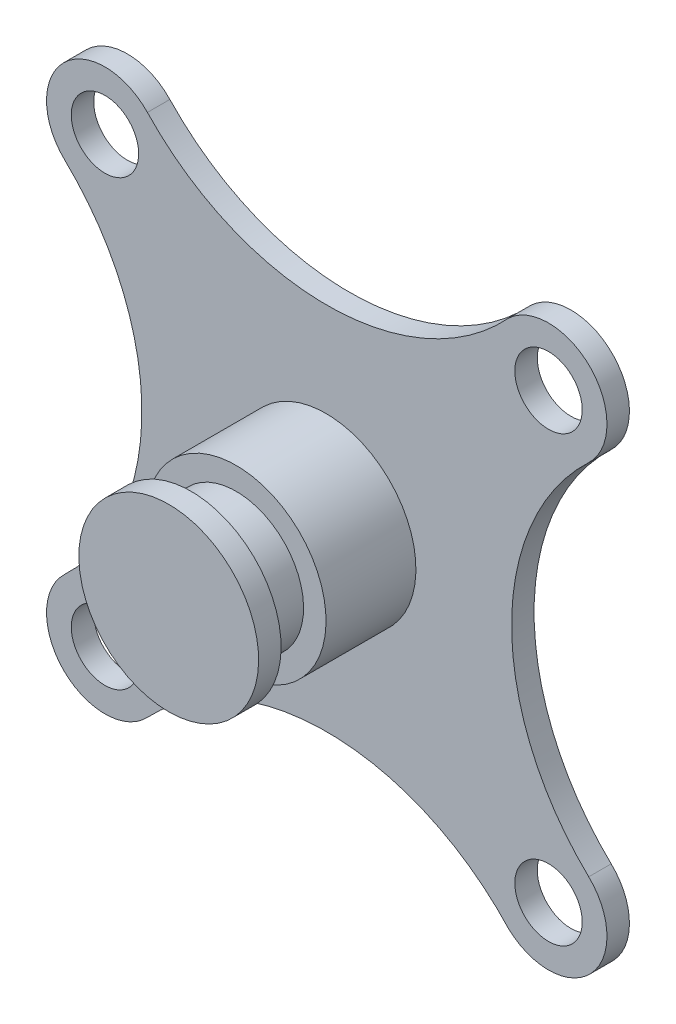
ISO-10303-21;
HEADER;
FILE_DESCRIPTION(('STEP AP214'),'2;1');
FILE_NAME('part.step','',(''),(''),'','','');
FILE_SCHEMA(('AUTOMOTIVE_DESIGN { 1 0 10303 214 1 1 1 1 }'));
ENDSEC;
DATA;
#1=APPLICATION_CONTEXT('core data for automotive mechanical design processes');
#2=APPLICATION_PROTOCOL_DEFINITION('international standard','automotive_design',2000,#1);
#3=PRODUCT_CONTEXT('',#1,'mechanical');
#4=PRODUCT('Part','Part','',(#3));
#5=PRODUCT_RELATED_PRODUCT_CATEGORY('part','',(#4));
#6=PRODUCT_DEFINITION_FORMATION('','',#4);
#7=PRODUCT_DEFINITION_CONTEXT('part definition',#1,'design');
#8=PRODUCT_DEFINITION('design','',#6,#7);
#9=PRODUCT_DEFINITION_SHAPE('','',#8);
#10=(LENGTH_UNIT() NAMED_UNIT(*) SI_UNIT(.MILLI.,.METRE.));
#11=(NAMED_UNIT(*) PLANE_ANGLE_UNIT() SI_UNIT($,.RADIAN.));
#12=(NAMED_UNIT(*) SI_UNIT($,.STERADIAN.) SOLID_ANGLE_UNIT());
#13=UNCERTAINTY_MEASURE_WITH_UNIT(LENGTH_MEASURE(1.E-05),#10,'distance_accuracy_value','');
#14=(GEOMETRIC_REPRESENTATION_CONTEXT(3) GLOBAL_UNCERTAINTY_ASSIGNED_CONTEXT((#13)) GLOBAL_UNIT_ASSIGNED_CONTEXT((#10,
#11,#12)) REPRESENTATION_CONTEXT('',''));
#15=CARTESIAN_POINT('',(0.,0.,0.));
#16=DIRECTION('',(0.,0.,1.));
#17=DIRECTION('',(1.,0.,0.));
#18=AXIS2_PLACEMENT_3D('',#15,#16,#17);
#19=CARTESIAN_POINT('',(-72.5815017066124,24.5154015644505,-20.));
#20=DIRECTION('',(0.,0.,1.));
#21=DIRECTION('',(0.,-1.,0.));
#22=AXIS2_PLACEMENT_3D('',#19,#20,#21);
#23=PLANE('',#22);
#24=CARTESIAN_POINT('',(0.,0.,-20.));
#25=DIRECTION('',(0.,0.,1.));
#26=DIRECTION('',(0.,-1.,0.));
#27=AXIS2_PLACEMENT_3D('',#24,#25,#26);
#28=CIRCLE('',#27,20.);
#29=CARTESIAN_POINT('',(0.,-20.,-20.));
#30=VERTEX_POINT('',#29);
#31=EDGE_CURVE('E204',#30,#30,#28,.T.);
#32=ORIENTED_EDGE('',*,*,#31,.F.);
#33=EDGE_LOOP('',(#32));
#34=FACE_BOUND('',#33,.T.);
#35=CARTESIAN_POINT('',(-49.1869407359166,-49.499803987487,-20.));
#36=DIRECTION('',(0.,0.,1.));
#37=DIRECTION('',(0.,-1.,0.));
#38=AXIS2_PLACEMENT_3D('',#35,#36,#37);
#39=CIRCLE('',#38,7.5);
#40=CARTESIAN_POINT('',(-49.1869407359166,-56.999803987487,-20.));
#41=VERTEX_POINT('',#40);
#42=EDGE_CURVE('E189',#41,#41,#39,.T.);
#43=ORIENTED_EDGE('',*,*,#42,.F.);
#44=EDGE_LOOP('',(#43));
#45=FACE_BOUND('',#44,.T.);
#46=CARTESIAN_POINT('',(-49.1869407359166,49.1871367484297,-20.));
#47=DIRECTION('',(0.,0.,1.));
#48=DIRECTION('',(0.,-1.,0.));
#49=AXIS2_PLACEMENT_3D('',#46,#47,#48);
#50=CIRCLE('',#49,7.5);
#51=CARTESIAN_POINT('',(-49.1869407359166,41.6871367484297,-20.));
#52=VERTEX_POINT('',#51);
#53=EDGE_CURVE('E135',#52,#52,#50,.T.);
#54=ORIENTED_EDGE('',*,*,#53,.F.);
#55=EDGE_LOOP('',(#54));
#56=FACE_BOUND('',#55,.T.);
#57=CARTESIAN_POINT('',(-95.9760626773083,-0.156333619528666,-20.));
#58=DIRECTION('',(0.,0.,-1.));
#59=DIRECTION('',(0.,-1.,0.));
#60=AXIS2_PLACEMENT_3D('',#57,#58,#59);
#61=CIRCLE('',#60,55.);
#62=CARTESIAN_POINT('',(-58.1319199305945,39.7538262369082,-20.));
#63=VERTEX_POINT('',#62);
#64=CARTESIAN_POINT('',(-58.1319199305944,-40.0664934759656,-20.));
#65=VERTEX_POINT('',#64);
#66=EDGE_CURVE('E146',#63,#65,#61,.T.);
#67=ORIENTED_EDGE('',*,*,#66,.T.);
#68=CARTESIAN_POINT('',(-49.1869407359166,-49.499803987487,-20.));
#69=DIRECTION('',(0.,0.,1.));
#70=DIRECTION('',(0.,-1.,0.));
#71=AXIS2_PLACEMENT_3D('',#68,#69,#70);
#72=CIRCLE('',#71,13.);
#73=CARTESIAN_POINT('',(-39.7492204837325,-58.4401304044313,-20.));
#74=VERTEX_POINT('',#73);
#75=EDGE_CURVE('E94',#65,#74,#72,.T.);
#76=ORIENTED_EDGE('',*,*,#75,.T.);
#77=CARTESIAN_POINT('',(0.179595967815818,-96.2645883222729,-20.));
#78=DIRECTION('',(0.,0.,-1.));
#79=DIRECTION('',(0.,-1.,0.));
#80=AXIS2_PLACEMENT_3D('',#77,#78,#79);
#81=CIRCLE('',#80,55.);
#82=CARTESIAN_POINT('',(40.6632357648317,-59.0345613442344,-20.));
#83=VERTEX_POINT('',#82);
#84=EDGE_CURVE('E161',#74,#83,#81,.T.);
#85=ORIENTED_EDGE('',*,*,#84,.T.);
#86=CARTESIAN_POINT('',(49.5,-49.499803987487,-20.));
#87=DIRECTION('',(0.,0.,1.));
#88=DIRECTION('',(0.,-1.,0.));
#89=AXIS2_PLACEMENT_3D('',#86,#87,#88);
#90=CIRCLE('',#89,13.);
#91=CARTESIAN_POINT('',(58.4449791946778,-40.0664934759655,-20.));
#92=VERTEX_POINT('',#91);
#93=EDGE_CURVE('E174',#83,#92,#90,.T.);
#94=ORIENTED_EDGE('',*,*,#93,.T.);
#95=CARTESIAN_POINT('',(96.2891219413917,-0.156333619528666,-20.));
#96=DIRECTION('',(0.,0.,-1.));
#97=DIRECTION('',(0.,1.,0.));
#98=AXIS2_PLACEMENT_3D('',#95,#96,#97);
#99=CIRCLE('',#98,55.);
#100=CARTESIAN_POINT('',(58.4449791946778,39.7538262369082,-20.));
#101=VERTEX_POINT('',#100);
#102=EDGE_CURVE('E113',#92,#101,#99,.T.);
#103=ORIENTED_EDGE('',*,*,#102,.T.);
#104=CARTESIAN_POINT('',(49.5,49.1871367484297,-20.));
#105=DIRECTION('',(0.,0.,1.));
#106=DIRECTION('',(0.,-1.,0.));
#107=AXIS2_PLACEMENT_3D('',#104,#105,#106);
#108=CIRCLE('',#107,13.);
#109=CARTESIAN_POINT('',(40.6632357648317,58.7218941051771,-20.));
#110=VERTEX_POINT('',#109);
#111=EDGE_CURVE('E107',#101,#110,#108,.T.);
#112=ORIENTED_EDGE('',*,*,#111,.T.);
#113=CARTESIAN_POINT('',(0.17959596781586,95.9519210832156,-20.));
#114=DIRECTION('',(0.,0.,-1.));
#115=DIRECTION('',(0.,1.,0.));
#116=AXIS2_PLACEMENT_3D('',#113,#114,#115);
#117=CIRCLE('',#116,55.);
#118=CARTESIAN_POINT('',(-39.7492204837324,58.127463165374,-20.));
#119=VERTEX_POINT('',#118);
#120=EDGE_CURVE('E111',#110,#119,#117,.T.);
#121=ORIENTED_EDGE('',*,*,#120,.T.);
#122=CARTESIAN_POINT('',(-49.1869407359166,49.1871367484297,-20.));
#123=DIRECTION('',(0.,0.,1.));
#124=DIRECTION('',(0.,-1.,0.));
#125=AXIS2_PLACEMENT_3D('',#122,#123,#124);
#126=CIRCLE('',#125,13.);
#127=EDGE_CURVE('E51',#119,#63,#126,.T.);
#128=ORIENTED_EDGE('',*,*,#127,.T.);
#129=EDGE_LOOP('',(#67,#76,#85,#94,#103,#112,#121,#128));
#130=FACE_BOUND('',#129,.T.);
#131=CARTESIAN_POINT('',(49.5,49.1871367484297,-20.));
#132=DIRECTION('',(0.,0.,1.));
#133=DIRECTION('',(0.,-1.,0.));
#134=AXIS2_PLACEMENT_3D('',#131,#132,#133);
#135=CIRCLE('',#134,7.5);
#136=CARTESIAN_POINT('',(49.5,41.6871367484297,-20.));
#137=VERTEX_POINT('',#136);
#138=EDGE_CURVE('E183',#137,#137,#135,.T.);
#139=ORIENTED_EDGE('',*,*,#138,.F.);
#140=EDGE_LOOP('',(#139));
#141=FACE_BOUND('',#140,.T.);
#142=CARTESIAN_POINT('',(49.5,-49.499803987487,-20.));
#143=DIRECTION('',(0.,0.,1.));
#144=DIRECTION('',(0.,-1.,0.));
#145=AXIS2_PLACEMENT_3D('',#142,#143,#144);
#146=CIRCLE('',#145,7.5);
#147=CARTESIAN_POINT('',(49.5,-56.999803987487,-20.));
#148=VERTEX_POINT('',#147);
#149=EDGE_CURVE('E195',#148,#148,#146,.T.);
#150=ORIENTED_EDGE('',*,*,#149,.F.);
#151=EDGE_LOOP('',(#150));
#152=FACE_BOUND('',#151,.T.);
#153=ADVANCED_FACE('F34',(#34,#45,#56,#130,#141,#152),#23,.T.);
#154=CARTESIAN_POINT('',(-72.5815017066124,24.5154015644505,-25.));
#155=DIRECTION('',(0.,0.,1.));
#156=DIRECTION('',(0.,-1.,0.));
#157=AXIS2_PLACEMENT_3D('',#154,#155,#156);
#158=PLANE('',#157);
#159=CARTESIAN_POINT('',(-95.9760626773083,-0.156333619528666,-25.));
#160=DIRECTION('',(0.,0.,-1.));
#161=DIRECTION('',(0.,-1.,0.));
#162=AXIS2_PLACEMENT_3D('',#159,#160,#161);
#163=CIRCLE('',#162,55.);
#164=CARTESIAN_POINT('',(-58.1319199305945,39.7538262369082,-25.));
#165=VERTEX_POINT('',#164);
#166=CARTESIAN_POINT('',(-58.1319199305944,-40.0664934759656,-25.));
#167=VERTEX_POINT('',#166);
#168=EDGE_CURVE('E131',#165,#167,#163,.T.);
#169=ORIENTED_EDGE('',*,*,#168,.F.);
#170=CARTESIAN_POINT('',(-49.1869407359166,49.1871367484297,-25.));
#171=DIRECTION('',(0.,0.,1.));
#172=DIRECTION('',(0.,-1.,0.));
#173=AXIS2_PLACEMENT_3D('',#170,#171,#172);
#174=CIRCLE('',#173,13.);
#175=CARTESIAN_POINT('',(-39.7492204837324,58.127463165374,-25.));
#176=VERTEX_POINT('',#175);
#177=EDGE_CURVE('E86',#176,#165,#174,.T.);
#178=ORIENTED_EDGE('',*,*,#177,.F.);
#179=CARTESIAN_POINT('',(0.17959596781586,95.9519210832156,-25.));
#180=DIRECTION('',(0.,0.,-1.));
#181=DIRECTION('',(0.,1.,0.));
#182=AXIS2_PLACEMENT_3D('',#179,#180,#181);
#183=CIRCLE('',#182,55.);
#184=CARTESIAN_POINT('',(40.6632357648317,58.7218941051771,-25.));
#185=VERTEX_POINT('',#184);
#186=EDGE_CURVE('E80',#185,#176,#183,.T.);
#187=ORIENTED_EDGE('',*,*,#186,.F.);
#188=CARTESIAN_POINT('',(49.5,49.1871367484297,-25.));
#189=DIRECTION('',(0.,0.,1.));
#190=DIRECTION('',(0.,-1.,0.));
#191=AXIS2_PLACEMENT_3D('',#188,#189,#190);
#192=CIRCLE('',#191,13.);
#193=CARTESIAN_POINT('',(58.4449791946778,39.7538262369082,-25.));
#194=VERTEX_POINT('',#193);
#195=EDGE_CURVE('E121',#194,#185,#192,.T.);
#196=ORIENTED_EDGE('',*,*,#195,.F.);
#197=CARTESIAN_POINT('',(96.2891219413917,-0.156333619528666,-25.));
#198=DIRECTION('',(0.,0.,-1.));
#199=DIRECTION('',(0.,1.,0.));
#200=AXIS2_PLACEMENT_3D('',#197,#198,#199);
#201=CIRCLE('',#200,55.);
#202=CARTESIAN_POINT('',(58.4449791946778,-40.0664934759655,-25.));
#203=VERTEX_POINT('',#202);
#204=EDGE_CURVE('E141',#203,#194,#201,.T.);
#205=ORIENTED_EDGE('',*,*,#204,.F.);
#206=CARTESIAN_POINT('',(49.5,-49.499803987487,-25.));
#207=DIRECTION('',(0.,0.,1.));
#208=DIRECTION('',(0.,-1.,0.));
#209=AXIS2_PLACEMENT_3D('',#206,#207,#208);
#210=CIRCLE('',#209,13.);
#211=CARTESIAN_POINT('',(40.6632357648317,-59.0345613442344,-25.));
#212=VERTEX_POINT('',#211);
#213=EDGE_CURVE('E139',#212,#203,#210,.T.);
#214=ORIENTED_EDGE('',*,*,#213,.F.);
#215=CARTESIAN_POINT('',(0.179595967815818,-96.2645883222729,-25.));
#216=DIRECTION('',(0.,0.,-1.));
#217=DIRECTION('',(0.,-1.,0.));
#218=AXIS2_PLACEMENT_3D('',#215,#216,#217);
#219=CIRCLE('',#218,55.);
#220=CARTESIAN_POINT('',(-39.7492204837325,-58.4401304044313,-25.));
#221=VERTEX_POINT('',#220);
#222=EDGE_CURVE('E137',#221,#212,#219,.T.);
#223=ORIENTED_EDGE('',*,*,#222,.F.);
#224=CARTESIAN_POINT('',(-49.1869407359166,-49.499803987487,-25.));
#225=DIRECTION('',(0.,0.,1.));
#226=DIRECTION('',(0.,-1.,0.));
#227=AXIS2_PLACEMENT_3D('',#224,#225,#226);
#228=CIRCLE('',#227,13.);
#229=EDGE_CURVE('E134',#167,#221,#228,.T.);
#230=ORIENTED_EDGE('',*,*,#229,.F.);
#231=EDGE_LOOP('',(#169,#178,#187,#196,#205,#214,#223,#230));
#232=FACE_BOUND('',#231,.T.);
#233=CARTESIAN_POINT('',(-49.1869407359166,49.1871367484297,-25.));
#234=DIRECTION('',(0.,0.,1.));
#235=DIRECTION('',(0.,-1.,0.));
#236=AXIS2_PLACEMENT_3D('',#233,#234,#235);
#237=CIRCLE('',#236,7.5);
#238=CARTESIAN_POINT('',(-49.1869407359166,41.6871367484297,-25.));
#239=VERTEX_POINT('',#238);
#240=EDGE_CURVE('E180',#239,#239,#237,.T.);
#241=ORIENTED_EDGE('',*,*,#240,.T.);
#242=EDGE_LOOP('',(#241));
#243=FACE_BOUND('',#242,.T.);
#244=CARTESIAN_POINT('',(49.5,49.1871367484297,-25.));
#245=DIRECTION('',(0.,0.,1.));
#246=DIRECTION('',(0.,-1.,0.));
#247=AXIS2_PLACEMENT_3D('',#244,#245,#246);
#248=CIRCLE('',#247,7.5);
#249=CARTESIAN_POINT('',(49.5,41.6871367484297,-25.));
#250=VERTEX_POINT('',#249);
#251=EDGE_CURVE('E186',#250,#250,#248,.T.);
#252=ORIENTED_EDGE('',*,*,#251,.T.);
#253=EDGE_LOOP('',(#252));
#254=FACE_BOUND('',#253,.T.);
#255=CARTESIAN_POINT('',(-49.1869407359166,-49.499803987487,-25.));
#256=DIRECTION('',(0.,0.,1.));
#257=DIRECTION('',(0.,-1.,0.));
#258=AXIS2_PLACEMENT_3D('',#255,#256,#257);
#259=CIRCLE('',#258,7.5);
#260=CARTESIAN_POINT('',(-49.1869407359166,-56.999803987487,-25.));
#261=VERTEX_POINT('',#260);
#262=EDGE_CURVE('E192',#261,#261,#259,.T.);
#263=ORIENTED_EDGE('',*,*,#262,.T.);
#264=EDGE_LOOP('',(#263));
#265=FACE_BOUND('',#264,.T.);
#266=CARTESIAN_POINT('',(49.5,-49.499803987487,-25.));
#267=DIRECTION('',(0.,0.,1.));
#268=DIRECTION('',(0.,-1.,0.));
#269=AXIS2_PLACEMENT_3D('',#266,#267,#268);
#270=CIRCLE('',#269,7.5);
#271=CARTESIAN_POINT('',(49.5,-56.999803987487,-25.));
#272=VERTEX_POINT('',#271);
#273=EDGE_CURVE('E198',#272,#272,#270,.T.);
#274=ORIENTED_EDGE('',*,*,#273,.T.);
#275=EDGE_LOOP('',(#274));
#276=FACE_BOUND('',#275,.T.);
#277=ADVANCED_FACE('F165',(#232,#243,#254,#265,#276),#158,.F.);
#278=CARTESIAN_POINT('',(-95.9760626773083,-0.156333619528666,-20.));
#279=DIRECTION('',(0.,0.,-1.));
#280=DIRECTION('',(0.,1.,0.));
#281=AXIS2_PLACEMENT_3D('',#278,#279,#280);
#282=CYLINDRICAL_SURFACE('',#281,55.);
#283=ORIENTED_EDGE('',*,*,#168,.T.);
#284=DIRECTION('',(0.,0.,-1.));
#285=VECTOR('',#284,1.);
#286=CARTESIAN_POINT('',(-58.1319199305944,-40.0664934759656,-20.));
#287=LINE('',#286,#285);
#288=EDGE_CURVE('E11',#65,#167,#287,.T.);
#289=ORIENTED_EDGE('',*,*,#288,.F.);
#290=ORIENTED_EDGE('',*,*,#66,.F.);
#291=DIRECTION('',(0.,0.,-1.));
#292=VECTOR('',#291,1.);
#293=CARTESIAN_POINT('',(-58.1319199305945,39.7538262369082,-20.));
#294=LINE('',#293,#292);
#295=EDGE_CURVE('E127',#63,#165,#294,.T.);
#296=ORIENTED_EDGE('',*,*,#295,.T.);
#297=EDGE_LOOP('',(#283,#289,#290,#296));
#298=FACE_BOUND('',#297,.T.);
#299=ADVANCED_FACE('F36',(#298),#282,.F.);
#300=CARTESIAN_POINT('',(-49.1869407359166,-49.499803987487,-20.));
#301=DIRECTION('',(0.,0.,-1.));
#302=DIRECTION('',(0.,1.,0.));
#303=AXIS2_PLACEMENT_3D('',#300,#301,#302);
#304=CYLINDRICAL_SURFACE('',#303,13.);
#305=ORIENTED_EDGE('',*,*,#229,.T.);
#306=DIRECTION('',(0.,0.,-1.));
#307=VECTOR('',#306,1.);
#308=CARTESIAN_POINT('',(-39.7492204837325,-58.4401304044313,-20.));
#309=LINE('',#308,#307);
#310=EDGE_CURVE('E43',#74,#221,#309,.T.);
#311=ORIENTED_EDGE('',*,*,#310,.F.);
#312=ORIENTED_EDGE('',*,*,#75,.F.);
#313=ORIENTED_EDGE('',*,*,#288,.T.);
#314=EDGE_LOOP('',(#305,#311,#312,#313));
#315=FACE_BOUND('',#314,.T.);
#316=ADVANCED_FACE('F264',(#315),#304,.T.);
#317=CARTESIAN_POINT('',(0.179595967815818,-96.2645883222729,-20.));
#318=DIRECTION('',(0.,0.,-1.));
#319=DIRECTION('',(0.,1.,0.));
#320=AXIS2_PLACEMENT_3D('',#317,#318,#319);
#321=CYLINDRICAL_SURFACE('',#320,55.);
#322=ORIENTED_EDGE('',*,*,#222,.T.);
#323=DIRECTION('',(0.,0.,-1.));
#324=VECTOR('',#323,1.);
#325=CARTESIAN_POINT('',(40.6632357648317,-59.0345613442344,-20.));
#326=LINE('',#325,#324);
#327=EDGE_CURVE('E153',#83,#212,#326,.T.);
#328=ORIENTED_EDGE('',*,*,#327,.F.);
#329=ORIENTED_EDGE('',*,*,#84,.F.);
#330=ORIENTED_EDGE('',*,*,#310,.T.);
#331=EDGE_LOOP('',(#322,#328,#329,#330));
#332=FACE_BOUND('',#331,.T.);
#333=ADVANCED_FACE('F159',(#332),#321,.F.);
#334=CARTESIAN_POINT('',(49.5,-49.499803987487,-20.));
#335=DIRECTION('',(0.,0.,-1.));
#336=DIRECTION('',(0.,1.,0.));
#337=AXIS2_PLACEMENT_3D('',#334,#335,#336);
#338=CYLINDRICAL_SURFACE('',#337,13.);
#339=ORIENTED_EDGE('',*,*,#213,.T.);
#340=DIRECTION('',(0.,0.,-1.));
#341=VECTOR('',#340,1.);
#342=CARTESIAN_POINT('',(58.4449791946778,-40.0664934759655,-20.));
#343=LINE('',#342,#341);
#344=EDGE_CURVE('E150',#92,#203,#343,.T.);
#345=ORIENTED_EDGE('',*,*,#344,.F.);
#346=ORIENTED_EDGE('',*,*,#93,.F.);
#347=ORIENTED_EDGE('',*,*,#327,.T.);
#348=EDGE_LOOP('',(#339,#345,#346,#347));
#349=FACE_BOUND('',#348,.T.);
#350=ADVANCED_FACE('F170',(#349),#338,.T.);
#351=CARTESIAN_POINT('',(96.2891219413917,-0.156333619528666,-20.));
#352=DIRECTION('',(0.,0.,-1.));
#353=DIRECTION('',(0.,1.,0.));
#354=AXIS2_PLACEMENT_3D('',#351,#352,#353);
#355=CYLINDRICAL_SURFACE('',#354,55.);
#356=ORIENTED_EDGE('',*,*,#204,.T.);
#357=DIRECTION('',(0.,0.,-1.));
#358=VECTOR('',#357,1.);
#359=CARTESIAN_POINT('',(58.4449791946778,39.7538262369082,-20.));
#360=LINE('',#359,#358);
#361=EDGE_CURVE('E122',#101,#194,#360,.T.);
#362=ORIENTED_EDGE('',*,*,#361,.F.);
#363=ORIENTED_EDGE('',*,*,#102,.F.);
#364=ORIENTED_EDGE('',*,*,#344,.T.);
#365=EDGE_LOOP('',(#356,#362,#363,#364));
#366=FACE_BOUND('',#365,.T.);
#367=ADVANCED_FACE('F173',(#366),#355,.F.);
#368=CARTESIAN_POINT('',(49.5,49.1871367484297,-20.));
#369=DIRECTION('',(0.,0.,-1.));
#370=DIRECTION('',(0.,1.,0.));
#371=AXIS2_PLACEMENT_3D('',#368,#369,#370);
#372=CYLINDRICAL_SURFACE('',#371,13.);
#373=ORIENTED_EDGE('',*,*,#195,.T.);
#374=DIRECTION('',(0.,0.,-1.));
#375=VECTOR('',#374,1.);
#376=CARTESIAN_POINT('',(40.6632357648317,58.7218941051771,-20.));
#377=LINE('',#376,#375);
#378=EDGE_CURVE('E118',#110,#185,#377,.T.);
#379=ORIENTED_EDGE('',*,*,#378,.F.);
#380=ORIENTED_EDGE('',*,*,#111,.F.);
#381=ORIENTED_EDGE('',*,*,#361,.T.);
#382=EDGE_LOOP('',(#373,#379,#380,#381));
#383=FACE_BOUND('',#382,.T.);
#384=ADVANCED_FACE('F119',(#383),#372,.T.);
#385=CARTESIAN_POINT('',(0.17959596781586,95.9519210832156,-20.));
#386=DIRECTION('',(0.,0.,-1.));
#387=DIRECTION('',(0.,1.,0.));
#388=AXIS2_PLACEMENT_3D('',#385,#386,#387);
#389=CYLINDRICAL_SURFACE('',#388,55.);
#390=ORIENTED_EDGE('',*,*,#186,.T.);
#391=DIRECTION('',(0.,0.,-1.));
#392=VECTOR('',#391,1.);
#393=CARTESIAN_POINT('',(-39.7492204837324,58.127463165374,-20.));
#394=LINE('',#393,#392);
#395=EDGE_CURVE('E123',#119,#176,#394,.T.);
#396=ORIENTED_EDGE('',*,*,#395,.F.);
#397=ORIENTED_EDGE('',*,*,#120,.F.);
#398=ORIENTED_EDGE('',*,*,#378,.T.);
#399=EDGE_LOOP('',(#390,#396,#397,#398));
#400=FACE_BOUND('',#399,.T.);
#401=ADVANCED_FACE('F125',(#400),#389,.F.);
#402=CARTESIAN_POINT('',(-49.1869407359166,49.1871367484297,-20.));
#403=DIRECTION('',(0.,0.,-1.));
#404=DIRECTION('',(0.,1.,0.));
#405=AXIS2_PLACEMENT_3D('',#402,#403,#404);
#406=CYLINDRICAL_SURFACE('',#405,13.);
#407=ORIENTED_EDGE('',*,*,#177,.T.);
#408=ORIENTED_EDGE('',*,*,#295,.F.);
#409=ORIENTED_EDGE('',*,*,#127,.F.);
#410=ORIENTED_EDGE('',*,*,#395,.T.);
#411=EDGE_LOOP('',(#407,#408,#409,#410));
#412=FACE_BOUND('',#411,.T.);
#413=ADVANCED_FACE('F252',(#412),#406,.T.);
#414=CARTESIAN_POINT('',(-49.1869407359166,49.1871367484297,-20.));
#415=DIRECTION('',(0.,0.,-1.));
#416=DIRECTION('',(0.,1.,0.));
#417=AXIS2_PLACEMENT_3D('',#414,#415,#416);
#418=CYLINDRICAL_SURFACE('',#417,7.5);
#419=ORIENTED_EDGE('',*,*,#53,.T.);
#420=EDGE_LOOP('',(#419));
#421=FACE_BOUND('',#420,.T.);
#422=ORIENTED_EDGE('',*,*,#240,.F.);
#423=EDGE_LOOP('',(#422));
#424=FACE_BOUND('',#423,.T.);
#425=ADVANCED_FACE('F249',(#421,#424),#418,.F.);
#426=CARTESIAN_POINT('',(49.5,49.1871367484297,-20.));
#427=DIRECTION('',(0.,0.,-1.));
#428=DIRECTION('',(0.,1.,0.));
#429=AXIS2_PLACEMENT_3D('',#426,#427,#428);
#430=CYLINDRICAL_SURFACE('',#429,7.5);
#431=ORIENTED_EDGE('',*,*,#138,.T.);
#432=EDGE_LOOP('',(#431));
#433=FACE_BOUND('',#432,.T.);
#434=ORIENTED_EDGE('',*,*,#251,.F.);
#435=EDGE_LOOP('',(#434));
#436=FACE_BOUND('',#435,.T.);
#437=ADVANCED_FACE('F328',(#433,#436),#430,.F.);
#438=CARTESIAN_POINT('',(-49.1869407359166,-49.499803987487,-20.));
#439=DIRECTION('',(0.,0.,-1.));
#440=DIRECTION('',(0.,1.,0.));
#441=AXIS2_PLACEMENT_3D('',#438,#439,#440);
#442=CYLINDRICAL_SURFACE('',#441,7.5);
#443=ORIENTED_EDGE('',*,*,#42,.T.);
#444=EDGE_LOOP('',(#443));
#445=FACE_BOUND('',#444,.T.);
#446=ORIENTED_EDGE('',*,*,#262,.F.);
#447=EDGE_LOOP('',(#446));
#448=FACE_BOUND('',#447,.T.);
#449=ADVANCED_FACE('F336',(#445,#448),#442,.F.);
#450=CARTESIAN_POINT('',(49.5,-49.499803987487,-20.));
#451=DIRECTION('',(0.,0.,-1.));
#452=DIRECTION('',(0.,1.,0.));
#453=AXIS2_PLACEMENT_3D('',#450,#451,#452);
#454=CYLINDRICAL_SURFACE('',#453,7.5);
#455=ORIENTED_EDGE('',*,*,#149,.T.);
#456=EDGE_LOOP('',(#455));
#457=FACE_BOUND('',#456,.T.);
#458=ORIENTED_EDGE('',*,*,#273,.F.);
#459=EDGE_LOOP('',(#458));
#460=FACE_BOUND('',#459,.T.);
#461=ADVANCED_FACE('F344',(#457,#460),#454,.F.);
#462=CARTESIAN_POINT('',(0.,0.,0.));
#463=DIRECTION('',(0.,0.,-1.));
#464=DIRECTION('',(0.,1.,0.));
#465=AXIS2_PLACEMENT_3D('',#462,#463,#464);
#466=CYLINDRICAL_SURFACE('',#465,20.);
#467=CARTESIAN_POINT('',(0.,0.,0.));
#468=DIRECTION('',(0.,0.,1.));
#469=DIRECTION('',(0.,-1.,0.));
#470=AXIS2_PLACEMENT_3D('',#467,#468,#469);
#471=CIRCLE('',#470,20.);
#472=CARTESIAN_POINT('',(0.,-20.,0.));
#473=VERTEX_POINT('',#472);
#474=EDGE_CURVE('E201',#473,#473,#471,.T.);
#475=ORIENTED_EDGE('',*,*,#474,.F.);
#476=EDGE_LOOP('',(#475));
#477=FACE_BOUND('',#476,.T.);
#478=ORIENTED_EDGE('',*,*,#31,.T.);
#479=EDGE_LOOP('',(#478));
#480=FACE_BOUND('',#479,.T.);
#481=ADVANCED_FACE('F353',(#477,#480),#466,.T.);
#482=CARTESIAN_POINT('',(0.,0.,0.));
#483=DIRECTION('',(0.,0.,1.));
#484=DIRECTION('',(0.,-1.,0.));
#485=AXIS2_PLACEMENT_3D('',#482,#483,#484);
#486=PLANE('',#485);
#487=CARTESIAN_POINT('',(0.,0.,0.));
#488=DIRECTION('',(0.,0.,1.));
#489=DIRECTION('',(0.,-1.,0.));
#490=AXIS2_PLACEMENT_3D('',#487,#488,#489);
#491=CIRCLE('',#490,15.);
#492=CARTESIAN_POINT('',(0.,-15.,0.));
#493=VERTEX_POINT('',#492);
#494=EDGE_CURVE('E210',#493,#493,#491,.T.);
#495=ORIENTED_EDGE('',*,*,#494,.F.);
#496=EDGE_LOOP('',(#495));
#497=FACE_BOUND('',#496,.T.);
#498=ORIENTED_EDGE('',*,*,#474,.T.);
#499=EDGE_LOOP('',(#498));
#500=FACE_BOUND('',#499,.T.);
#501=ADVANCED_FACE('F362',(#497,#500),#486,.T.);
#502=CARTESIAN_POINT('',(0.,0.,10.));
#503=DIRECTION('',(0.,0.,-1.));
#504=DIRECTION('',(0.,1.,0.));
#505=AXIS2_PLACEMENT_3D('',#502,#503,#504);
#506=CYLINDRICAL_SURFACE('',#505,15.);
#507=CARTESIAN_POINT('',(0.,0.,10.));
#508=DIRECTION('',(0.,0.,1.));
#509=DIRECTION('',(0.,-1.,0.));
#510=AXIS2_PLACEMENT_3D('',#507,#508,#509);
#511=CIRCLE('',#510,15.);
#512=CARTESIAN_POINT('',(0.,-15.,10.));
#513=VERTEX_POINT('',#512);
#514=EDGE_CURVE('E207',#513,#513,#511,.T.);
#515=ORIENTED_EDGE('',*,*,#514,.F.);
#516=EDGE_LOOP('',(#515));
#517=FACE_BOUND('',#516,.T.);
#518=ORIENTED_EDGE('',*,*,#494,.T.);
#519=EDGE_LOOP('',(#518));
#520=FACE_BOUND('',#519,.T.);
#521=ADVANCED_FACE('F227',(#517,#520),#506,.T.);
#522=CARTESIAN_POINT('',(0.,0.,15.));
#523=DIRECTION('',(0.,0.,-1.));
#524=DIRECTION('',(0.,1.,0.));
#525=AXIS2_PLACEMENT_3D('',#522,#523,#524);
#526=CYLINDRICAL_SURFACE('',#525,20.);
#527=CARTESIAN_POINT('',(0.,0.,15.));
#528=DIRECTION('',(0.,0.,1.));
#529=DIRECTION('',(0.,-1.,0.));
#530=AXIS2_PLACEMENT_3D('',#527,#528,#529);
#531=CIRCLE('',#530,20.);
#532=CARTESIAN_POINT('',(0.,-20.,15.));
#533=VERTEX_POINT('',#532);
#534=EDGE_CURVE('E213',#533,#533,#531,.T.);
#535=ORIENTED_EDGE('',*,*,#534,.F.);
#536=EDGE_LOOP('',(#535));
#537=FACE_BOUND('',#536,.T.);
#538=CARTESIAN_POINT('',(0.,0.,10.));
#539=DIRECTION('',(0.,0.,1.));
#540=DIRECTION('',(0.,-1.,0.));
#541=AXIS2_PLACEMENT_3D('',#538,#539,#540);
#542=CIRCLE('',#541,20.);
#543=CARTESIAN_POINT('',(0.,-20.,10.));
#544=VERTEX_POINT('',#543);
#545=EDGE_CURVE('E216',#544,#544,#542,.T.);
#546=ORIENTED_EDGE('',*,*,#545,.T.);
#547=EDGE_LOOP('',(#546));
#548=FACE_BOUND('',#547,.T.);
#549=ADVANCED_FACE('F224',(#537,#548),#526,.T.);
#550=CARTESIAN_POINT('',(0.,0.,15.));
#551=DIRECTION('',(0.,0.,1.));
#552=DIRECTION('',(0.,-1.,0.));
#553=AXIS2_PLACEMENT_3D('',#550,#551,#552);
#554=PLANE('',#553);
#555=ORIENTED_EDGE('',*,*,#534,.T.);
#556=EDGE_LOOP('',(#555));
#557=FACE_BOUND('',#556,.T.);
#558=ADVANCED_FACE('F222',(#557),#554,.T.);
#559=CARTESIAN_POINT('',(0.,0.,10.));
#560=DIRECTION('',(0.,0.,1.));
#561=DIRECTION('',(0.,-1.,0.));
#562=AXIS2_PLACEMENT_3D('',#559,#560,#561);
#563=PLANE('',#562);
#564=ORIENTED_EDGE('',*,*,#514,.T.);
#565=EDGE_LOOP('',(#564));
#566=FACE_BOUND('',#565,.T.);
#567=ORIENTED_EDGE('',*,*,#545,.F.);
#568=EDGE_LOOP('',(#567));
#569=FACE_BOUND('',#568,.T.);
#570=ADVANCED_FACE('F231',(#566,#569),#563,.F.);
#571=CLOSED_SHELL('',(#153,#277,#299,#316,#333,#350,#367,#384,#401,#413,#425,#437,#449,#461,
#481,#501,#521,#549,#558,#570));
#572=MANIFOLD_SOLID_BREP('B2',#571);
#573=ADVANCED_BREP_SHAPE_REPRESENTATION('',(#18,#572),#14);
#574=SHAPE_DEFINITION_REPRESENTATION(#9,#573);
ENDSEC;
END-ISO-10303-21;
